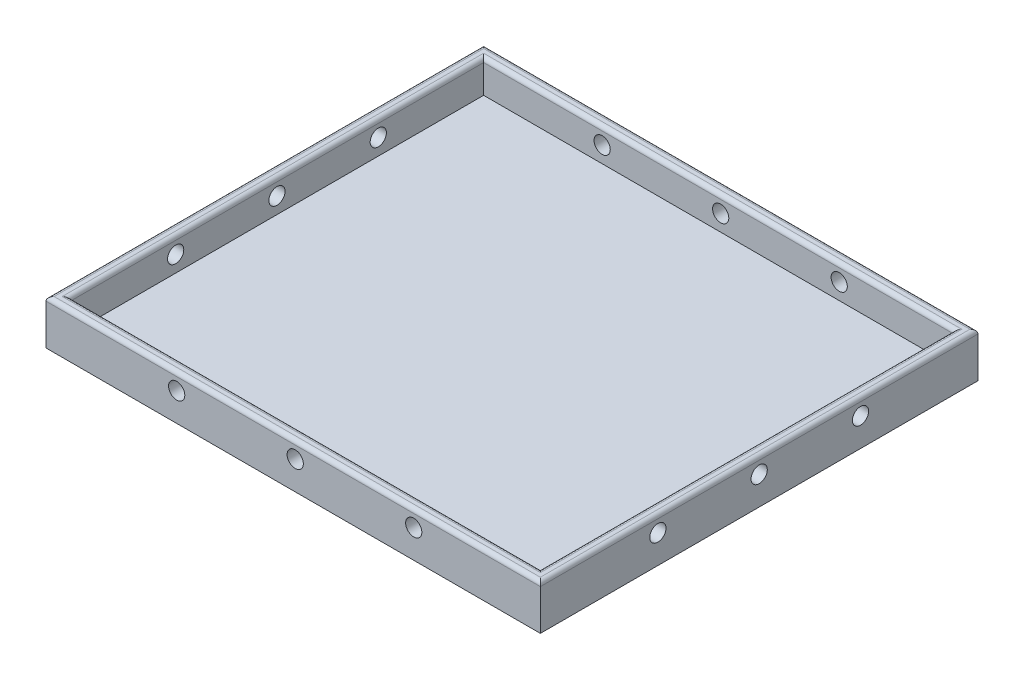
ISO-10303-21;
HEADER;
FILE_DESCRIPTION(('STEP AP214'),'2;1');
FILE_NAME('part.step','',(''),(''),'','','');
FILE_SCHEMA(('AUTOMOTIVE_DESIGN { 1 0 10303 214 1 1 1 1 }'));
ENDSEC;
DATA;
#1=APPLICATION_CONTEXT('core data for automotive mechanical design processes');
#2=APPLICATION_PROTOCOL_DEFINITION('international standard','automotive_design',2000,#1);
#3=PRODUCT_CONTEXT('',#1,'mechanical');
#4=PRODUCT('Part','Part','',(#3));
#5=PRODUCT_RELATED_PRODUCT_CATEGORY('part','',(#4));
#6=PRODUCT_DEFINITION_FORMATION('','',#4);
#7=PRODUCT_DEFINITION_CONTEXT('part definition',#1,'design');
#8=PRODUCT_DEFINITION('design','',#6,#7);
#9=PRODUCT_DEFINITION_SHAPE('','',#8);
#10=(LENGTH_UNIT() NAMED_UNIT(*) SI_UNIT(.MILLI.,.METRE.));
#11=(NAMED_UNIT(*) PLANE_ANGLE_UNIT() SI_UNIT($,.RADIAN.));
#12=(NAMED_UNIT(*) SI_UNIT($,.STERADIAN.) SOLID_ANGLE_UNIT());
#13=UNCERTAINTY_MEASURE_WITH_UNIT(LENGTH_MEASURE(1.E-05),#10,'distance_accuracy_value','');
#14=(GEOMETRIC_REPRESENTATION_CONTEXT(3) GLOBAL_UNCERTAINTY_ASSIGNED_CONTEXT((#13)) GLOBAL_UNIT_ASSIGNED_CONTEXT((#10,
#11,#12)) REPRESENTATION_CONTEXT('',''));
#15=CARTESIAN_POINT('',(0.,0.,0.));
#16=DIRECTION('',(0.,0.,1.));
#17=DIRECTION('',(1.,0.,0.));
#18=AXIS2_PLACEMENT_3D('',#15,#16,#17);
#19=CARTESIAN_POINT('',(-201.609907120743,11.,-77.8947368421052));
#20=DIRECTION('',(1.,0.,0.));
#21=DIRECTION('',(0.,0.,-1.));
#22=AXIS2_PLACEMENT_3D('',#19,#20,#21);
#23=PLANE('',#22);
#24=CARTESIAN_POINT('',(-201.609907120743,6.99999997663109,1.10526315789476));
#25=DIRECTION('',(1.,0.,0.));
#26=DIRECTION('',(0.,0.,-1.));
#27=AXIS2_PLACEMENT_3D('',#24,#25,#26);
#28=CIRCLE('',#27,1.99999999316759);
#29=CARTESIAN_POINT('',(-201.609907120743,6.99999997663109,-0.894736835272832));
#30=VERTEX_POINT('',#29);
#31=EDGE_CURVE('E190',#30,#30,#28,.T.);
#32=ORIENTED_EDGE('',*,*,#31,.T.);
#33=EDGE_LOOP('',(#32));
#34=FACE_BOUND('',#33,.T.);
#35=CARTESIAN_POINT('',(-201.609907120743,6.99999998831555,-23.8947368421052));
#36=DIRECTION('',(1.,0.,0.));
#37=DIRECTION('',(0.,0.,-1.));
#38=AXIS2_PLACEMENT_3D('',#35,#36,#37);
#39=CIRCLE('',#38,1.9999999931676);
#40=CARTESIAN_POINT('',(-201.609907120743,6.99999998831555,-25.8947368352728));
#41=VERTEX_POINT('',#40);
#42=EDGE_CURVE('E593',#41,#41,#39,.T.);
#43=ORIENTED_EDGE('',*,*,#42,.T.);
#44=EDGE_LOOP('',(#43));
#45=FACE_BOUND('',#44,.T.);
#46=CARTESIAN_POINT('',(-201.609907120743,7.,-48.8947368421052));
#47=DIRECTION('',(1.,0.,0.));
#48=DIRECTION('',(0.,0.,-1.));
#49=AXIS2_PLACEMENT_3D('',#46,#47,#48);
#50=CIRCLE('',#49,2.);
#51=CARTESIAN_POINT('',(-201.609907120743,7.,-50.8947368421052));
#52=VERTEX_POINT('',#51);
#53=EDGE_CURVE('E586',#52,#52,#50,.T.);
#54=ORIENTED_EDGE('',*,*,#53,.T.);
#55=EDGE_LOOP('',(#54));
#56=FACE_BOUND('',#55,.T.);
#57=DIRECTION('',(0.,-1.,0.));
#58=VECTOR('',#57,1.);
#59=CARTESIAN_POINT('',(-201.609907120743,11.,30.1052631578948));
#60=LINE('',#59,#58);
#61=CARTESIAN_POINT('',(-201.609907120743,10.,30.1052631578948));
#62=VERTEX_POINT('',#61);
#63=CARTESIAN_POINT('',(-201.609907120743,0.,30.1052631578948));
#64=VERTEX_POINT('',#63);
#65=EDGE_CURVE('E183',#62,#64,#60,.T.);
#66=ORIENTED_EDGE('',*,*,#65,.F.);
#67=DIRECTION('',(0.,0.,1.));
#68=VECTOR('',#67,1.);
#69=CARTESIAN_POINT('',(-201.609907120743,10.,-77.8947368421052));
#70=LINE('',#69,#68);
#71=CARTESIAN_POINT('',(-201.609907120743,10.,-77.8947368421052));
#72=VERTEX_POINT('',#71);
#73=EDGE_CURVE('E44',#62,#72,#70,.F.);
#74=ORIENTED_EDGE('',*,*,#73,.T.);
#75=DIRECTION('',(0.,-1.,0.));
#76=VECTOR('',#75,1.);
#77=CARTESIAN_POINT('',(-201.609907120743,11.,-77.8947368421052));
#78=LINE('',#77,#76);
#79=CARTESIAN_POINT('',(-201.609907120743,0.,-77.8947368421052));
#80=VERTEX_POINT('',#79);
#81=EDGE_CURVE('E177',#72,#80,#78,.T.);
#82=ORIENTED_EDGE('',*,*,#81,.T.);
#83=DIRECTION('',(0.,0.,1.));
#84=VECTOR('',#83,1.);
#85=CARTESIAN_POINT('',(-201.609907120743,0.,-77.8947368421052));
#86=LINE('',#85,#84);
#87=EDGE_CURVE('E162',#80,#64,#86,.T.);
#88=ORIENTED_EDGE('',*,*,#87,.T.);
#89=EDGE_LOOP('',(#66,#74,#82,#88));
#90=FACE_BOUND('',#89,.T.);
#91=ADVANCED_FACE('F35',(#34,#45,#56,#90),#23,.F.);
#92=CARTESIAN_POINT('',(-201.609907120743,11.,30.1052631578948));
#93=DIRECTION('',(0.,0.,-1.));
#94=DIRECTION('',(-1.,0.,0.));
#95=AXIS2_PLACEMENT_3D('',#92,#93,#94);
#96=PLANE('',#95);
#97=CARTESIAN_POINT('',(-169.359907120743,7.,30.1052631578948));
#98=DIRECTION('',(0.,0.,1.));
#99=DIRECTION('',(1.,0.,0.));
#100=AXIS2_PLACEMENT_3D('',#97,#98,#99);
#101=CIRCLE('',#100,2.);
#102=CARTESIAN_POINT('',(-167.359907120743,7.,30.1052631578948));
#103=VERTEX_POINT('',#102);
#104=EDGE_CURVE('E621',#103,#103,#101,.T.);
#105=ORIENTED_EDGE('',*,*,#104,.F.);
#106=EDGE_LOOP('',(#105));
#107=FACE_BOUND('',#106,.T.);
#108=CARTESIAN_POINT('',(-140.109907120743,7.,30.1052631578948));
#109=DIRECTION('',(0.,0.,1.));
#110=DIRECTION('',(1.,0.,0.));
#111=AXIS2_PLACEMENT_3D('',#108,#109,#110);
#112=CIRCLE('',#111,2.);
#113=CARTESIAN_POINT('',(-138.109907120743,7.,30.1052631578948));
#114=VERTEX_POINT('',#113);
#115=EDGE_CURVE('E615',#114,#114,#112,.T.);
#116=ORIENTED_EDGE('',*,*,#115,.F.);
#117=EDGE_LOOP('',(#116));
#118=FACE_BOUND('',#117,.T.);
#119=CARTESIAN_POINT('',(-110.859907120743,7.,30.1052631578948));
#120=DIRECTION('',(0.,0.,1.));
#121=DIRECTION('',(1.,0.,0.));
#122=AXIS2_PLACEMENT_3D('',#119,#120,#121);
#123=CIRCLE('',#122,2.);
#124=CARTESIAN_POINT('',(-108.859907120743,7.,30.1052631578948));
#125=VERTEX_POINT('',#124);
#126=EDGE_CURVE('E249',#125,#125,#123,.T.);
#127=ORIENTED_EDGE('',*,*,#126,.F.);
#128=EDGE_LOOP('',(#127));
#129=FACE_BOUND('',#128,.T.);
#130=DIRECTION('',(0.,-1.,0.));
#131=VECTOR('',#130,1.);
#132=CARTESIAN_POINT('',(-79.6099071207431,11.,30.1052631578948));
#133=LINE('',#132,#131);
#134=CARTESIAN_POINT('',(-79.6099071207431,10.,30.1052631578948));
#135=VERTEX_POINT('',#134);
#136=CARTESIAN_POINT('',(-79.6099071207431,0.,30.1052631578948));
#137=VERTEX_POINT('',#136);
#138=EDGE_CURVE('E181',#135,#137,#133,.T.);
#139=ORIENTED_EDGE('',*,*,#138,.F.);
#140=DIRECTION('',(1.,0.,0.));
#141=VECTOR('',#140,1.);
#142=CARTESIAN_POINT('',(-201.609907120743,10.,30.1052631578948));
#143=LINE('',#142,#141);
#144=EDGE_CURVE('E229',#135,#62,#143,.F.);
#145=ORIENTED_EDGE('',*,*,#144,.T.);
#146=ORIENTED_EDGE('',*,*,#65,.T.);
#147=DIRECTION('',(1.,0.,0.));
#148=VECTOR('',#147,1.);
#149=CARTESIAN_POINT('',(-201.609907120743,0.,30.1052631578948));
#150=LINE('',#149,#148);
#151=EDGE_CURVE('E168',#64,#137,#150,.T.);
#152=ORIENTED_EDGE('',*,*,#151,.T.);
#153=EDGE_LOOP('',(#139,#145,#146,#152));
#154=FACE_BOUND('',#153,.T.);
#155=ADVANCED_FACE('F281',(#107,#118,#129,#154),#96,.F.);
#156=CARTESIAN_POINT('',(-79.6099071207431,11.,-77.8947368421052));
#157=DIRECTION('',(-1.,0.,0.));
#158=DIRECTION('',(0.,0.,1.));
#159=AXIS2_PLACEMENT_3D('',#156,#157,#158);
#160=PLANE('',#159);
#161=CARTESIAN_POINT('',(-79.6099071207431,6.99999997663109,1.10526315789476));
#162=DIRECTION('',(1.,0.,0.));
#163=DIRECTION('',(0.,0.,-1.));
#164=AXIS2_PLACEMENT_3D('',#161,#162,#163);
#165=CIRCLE('',#164,1.99999999316759);
#166=CARTESIAN_POINT('',(-79.6099071207431,6.99999997663109,-0.894736835272832));
#167=VERTEX_POINT('',#166);
#168=EDGE_CURVE('E578',#167,#167,#165,.T.);
#169=ORIENTED_EDGE('',*,*,#168,.F.);
#170=EDGE_LOOP('',(#169));
#171=FACE_BOUND('',#170,.T.);
#172=CARTESIAN_POINT('',(-79.6099071207431,6.99999998831555,-23.8947368421052));
#173=DIRECTION('',(1.,0.,0.));
#174=DIRECTION('',(0.,0.,-1.));
#175=AXIS2_PLACEMENT_3D('',#172,#173,#174);
#176=CIRCLE('',#175,1.9999999931676);
#177=CARTESIAN_POINT('',(-79.6099071207431,6.99999998831555,-25.8947368352728));
#178=VERTEX_POINT('',#177);
#179=EDGE_CURVE('E582',#178,#178,#176,.T.);
#180=ORIENTED_EDGE('',*,*,#179,.F.);
#181=EDGE_LOOP('',(#180));
#182=FACE_BOUND('',#181,.T.);
#183=CARTESIAN_POINT('',(-79.6099071207431,7.,-48.8947368421052));
#184=DIRECTION('',(1.,0.,0.));
#185=DIRECTION('',(0.,0.,-1.));
#186=AXIS2_PLACEMENT_3D('',#183,#184,#185);
#187=CIRCLE('',#186,2.);
#188=CARTESIAN_POINT('',(-79.6099071207431,7.,-50.8947368421052));
#189=VERTEX_POINT('',#188);
#190=EDGE_CURVE('E585',#189,#189,#187,.T.);
#191=ORIENTED_EDGE('',*,*,#190,.F.);
#192=EDGE_LOOP('',(#191));
#193=FACE_BOUND('',#192,.T.);
#194=DIRECTION('',(0.,-1.,0.));
#195=VECTOR('',#194,1.);
#196=CARTESIAN_POINT('',(-79.6099071207431,11.,-77.8947368421052));
#197=LINE('',#196,#195);
#198=CARTESIAN_POINT('',(-79.6099071207431,10.,-77.8947368421052));
#199=VERTEX_POINT('',#198);
#200=CARTESIAN_POINT('',(-79.6099071207431,0.,-77.8947368421052));
#201=VERTEX_POINT('',#200);
#202=EDGE_CURVE('E179',#199,#201,#197,.T.);
#203=ORIENTED_EDGE('',*,*,#202,.F.);
#204=DIRECTION('',(0.,0.,-1.));
#205=VECTOR('',#204,1.);
#206=CARTESIAN_POINT('',(-79.6099071207431,10.,30.1052631578948));
#207=LINE('',#206,#205);
#208=EDGE_CURVE('E232',#199,#135,#207,.F.);
#209=ORIENTED_EDGE('',*,*,#208,.T.);
#210=ORIENTED_EDGE('',*,*,#138,.T.);
#211=DIRECTION('',(0.,0.,-1.));
#212=VECTOR('',#211,1.);
#213=CARTESIAN_POINT('',(-79.6099071207431,0.,-77.8947368421052));
#214=LINE('',#213,#212);
#215=EDGE_CURVE('E171',#137,#201,#214,.T.);
#216=ORIENTED_EDGE('',*,*,#215,.T.);
#217=EDGE_LOOP('',(#203,#209,#210,#216));
#218=FACE_BOUND('',#217,.T.);
#219=ADVANCED_FACE('F272',(#171,#182,#193,#218),#160,.F.);
#220=CARTESIAN_POINT('',(-201.609907120743,11.,-77.8947368421052));
#221=DIRECTION('',(0.,0.,1.));
#222=DIRECTION('',(1.,0.,0.));
#223=AXIS2_PLACEMENT_3D('',#220,#221,#222);
#224=PLANE('',#223);
#225=CARTESIAN_POINT('',(-169.359907120743,7.,-77.8947368421052));
#226=DIRECTION('',(0.,0.,1.));
#227=DIRECTION('',(1.,0.,0.));
#228=AXIS2_PLACEMENT_3D('',#225,#226,#227);
#229=CIRCLE('',#228,2.);
#230=CARTESIAN_POINT('',(-167.359907120743,7.,-77.8947368421052));
#231=VERTEX_POINT('',#230);
#232=EDGE_CURVE('E201',#231,#231,#229,.T.);
#233=ORIENTED_EDGE('',*,*,#232,.T.);
#234=EDGE_LOOP('',(#233));
#235=FACE_BOUND('',#234,.T.);
#236=CARTESIAN_POINT('',(-140.109907120743,7.,-77.8947368421052));
#237=DIRECTION('',(0.,0.,1.));
#238=DIRECTION('',(1.,0.,0.));
#239=AXIS2_PLACEMENT_3D('',#236,#237,#238);
#240=CIRCLE('',#239,2.);
#241=CARTESIAN_POINT('',(-138.109907120743,7.,-77.8947368421052));
#242=VERTEX_POINT('',#241);
#243=EDGE_CURVE('E618',#242,#242,#240,.T.);
#244=ORIENTED_EDGE('',*,*,#243,.T.);
#245=EDGE_LOOP('',(#244));
#246=FACE_BOUND('',#245,.T.);
#247=CARTESIAN_POINT('',(-110.859907120743,7.,-77.8947368421052));
#248=DIRECTION('',(0.,0.,1.));
#249=DIRECTION('',(1.,0.,0.));
#250=AXIS2_PLACEMENT_3D('',#247,#248,#249);
#251=CIRCLE('',#250,2.);
#252=CARTESIAN_POINT('',(-108.859907120743,7.,-77.8947368421052));
#253=VERTEX_POINT('',#252);
#254=EDGE_CURVE('E612',#253,#253,#251,.T.);
#255=ORIENTED_EDGE('',*,*,#254,.T.);
#256=EDGE_LOOP('',(#255));
#257=FACE_BOUND('',#256,.T.);
#258=ORIENTED_EDGE('',*,*,#81,.F.);
#259=DIRECTION('',(-1.,0.,0.));
#260=VECTOR('',#259,1.);
#261=CARTESIAN_POINT('',(-79.6099071207431,10.,-77.8947368421052));
#262=LINE('',#261,#260);
#263=EDGE_CURVE('E11',#72,#199,#262,.F.);
#264=ORIENTED_EDGE('',*,*,#263,.T.);
#265=ORIENTED_EDGE('',*,*,#202,.T.);
#266=DIRECTION('',(-1.,0.,0.));
#267=VECTOR('',#266,1.);
#268=CARTESIAN_POINT('',(-201.609907120743,0.,-77.8947368421052));
#269=LINE('',#268,#267);
#270=EDGE_CURVE('E174',#201,#80,#269,.T.);
#271=ORIENTED_EDGE('',*,*,#270,.T.);
#272=EDGE_LOOP('',(#258,#264,#265,#271));
#273=FACE_BOUND('',#272,.T.);
#274=ADVANCED_FACE('F270',(#235,#246,#257,#273),#224,.F.);
#275=CARTESIAN_POINT('',(0.,11.,0.));
#276=DIRECTION('',(0.,1.,0.));
#277=DIRECTION('',(0.,0.,1.));
#278=AXIS2_PLACEMENT_3D('',#275,#276,#277);
#279=PLANE('',#278);
#280=DIRECTION('',(0.,0.,-1.));
#281=VECTOR('',#280,1.);
#282=CARTESIAN_POINT('',(-81.6099071207431,11.,27.1052631578948));
#283=LINE('',#282,#281);
#284=CARTESIAN_POINT('',(-81.6099071207431,11.,-75.8947368421052));
#285=VERTEX_POINT('',#284);
#286=CARTESIAN_POINT('',(-81.6099071207431,11.,28.1052631578948));
#287=VERTEX_POINT('',#286);
#288=EDGE_CURVE('E224',#285,#287,#283,.F.);
#289=ORIENTED_EDGE('',*,*,#288,.T.);
#290=DIRECTION('',(1.,0.,0.));
#291=VECTOR('',#290,1.);
#292=CARTESIAN_POINT('',(-198.609907120743,11.,28.1052631578948));
#293=LINE('',#292,#291);
#294=CARTESIAN_POINT('',(-199.609907120743,11.,28.1052631578948));
#295=VERTEX_POINT('',#294);
#296=EDGE_CURVE('E226',#287,#295,#293,.F.);
#297=ORIENTED_EDGE('',*,*,#296,.T.);
#298=DIRECTION('',(0.,0.,1.));
#299=VECTOR('',#298,1.);
#300=CARTESIAN_POINT('',(-199.609907120743,11.,-74.8947368421052));
#301=LINE('',#300,#299);
#302=CARTESIAN_POINT('',(-199.609907120743,11.,-75.8947368421052));
#303=VERTEX_POINT('',#302);
#304=EDGE_CURVE('E222',#295,#303,#301,.F.);
#305=ORIENTED_EDGE('',*,*,#304,.T.);
#306=DIRECTION('',(-1.,0.,0.));
#307=VECTOR('',#306,1.);
#308=CARTESIAN_POINT('',(-82.6099071207431,11.,-75.8947368421052));
#309=LINE('',#308,#307);
#310=EDGE_CURVE('E220',#303,#285,#309,.F.);
#311=ORIENTED_EDGE('',*,*,#310,.T.);
#312=EDGE_LOOP('',(#289,#297,#305,#311));
#313=FACE_BOUND('',#312,.T.);
#314=DIRECTION('',(0.,0.,1.));
#315=VECTOR('',#314,1.);
#316=CARTESIAN_POINT('',(-200.609907120743,11.,30.1052631578948));
#317=LINE('',#316,#315);
#318=CARTESIAN_POINT('',(-200.609907120743,11.,-76.8947368421052));
#319=VERTEX_POINT('',#318);
#320=CARTESIAN_POINT('',(-200.609907120743,11.,29.1052631578948));
#321=VERTEX_POINT('',#320);
#322=EDGE_CURVE('E213',#319,#321,#317,.T.);
#323=ORIENTED_EDGE('',*,*,#322,.T.);
#324=DIRECTION('',(1.,0.,0.));
#325=VECTOR('',#324,1.);
#326=CARTESIAN_POINT('',(-79.6099071207431,11.,29.1052631578948));
#327=LINE('',#326,#325);
#328=CARTESIAN_POINT('',(-80.6099071207431,11.,29.1052631578948));
#329=VERTEX_POINT('',#328);
#330=EDGE_CURVE('E217',#321,#329,#327,.T.);
#331=ORIENTED_EDGE('',*,*,#330,.T.);
#332=DIRECTION('',(0.,0.,-1.));
#333=VECTOR('',#332,1.);
#334=CARTESIAN_POINT('',(-80.6099071207431,11.,-77.8947368421052));
#335=LINE('',#334,#333);
#336=CARTESIAN_POINT('',(-80.6099071207431,11.,-76.8947368421052));
#337=VERTEX_POINT('',#336);
#338=EDGE_CURVE('E215',#329,#337,#335,.T.);
#339=ORIENTED_EDGE('',*,*,#338,.T.);
#340=DIRECTION('',(-1.,0.,0.));
#341=VECTOR('',#340,1.);
#342=CARTESIAN_POINT('',(-201.609907120743,11.,-76.8947368421052));
#343=LINE('',#342,#341);
#344=EDGE_CURVE('E211',#337,#319,#343,.T.);
#345=ORIENTED_EDGE('',*,*,#344,.T.);
#346=EDGE_LOOP('',(#323,#331,#339,#345));
#347=FACE_BOUND('',#346,.T.);
#348=ADVANCED_FACE('F289',(#313,#347),#279,.T.);
#349=CARTESIAN_POINT('',(0.,0.,0.));
#350=DIRECTION('',(0.,1.,0.));
#351=DIRECTION('',(0.,0.,1.));
#352=AXIS2_PLACEMENT_3D('',#349,#350,#351);
#353=PLANE('',#352);
#354=ORIENTED_EDGE('',*,*,#87,.F.);
#355=ORIENTED_EDGE('',*,*,#270,.F.);
#356=ORIENTED_EDGE('',*,*,#215,.F.);
#357=ORIENTED_EDGE('',*,*,#151,.F.);
#358=EDGE_LOOP('',(#354,#355,#356,#357));
#359=FACE_BOUND('',#358,.T.);
#360=ADVANCED_FACE('F279',(#359),#353,.F.);
#361=CARTESIAN_POINT('',(-198.609907120743,3.,-74.8947368421052));
#362=DIRECTION('',(-1.,0.,0.));
#363=DIRECTION('',(0.,0.,1.));
#364=AXIS2_PLACEMENT_3D('',#361,#362,#363);
#365=PLANE('',#364);
#366=CARTESIAN_POINT('',(-198.609907120743,6.99999997663109,1.10526315789476));
#367=DIRECTION('',(-1.,0.,0.));
#368=DIRECTION('',(0.,0.,1.));
#369=AXIS2_PLACEMENT_3D('',#366,#367,#368);
#370=CIRCLE('',#369,1.99999999316759);
#371=CARTESIAN_POINT('',(-198.609907120743,6.99999997663109,3.10526315106236));
#372=VERTEX_POINT('',#371);
#373=EDGE_CURVE('E151',#372,#372,#370,.T.);
#374=ORIENTED_EDGE('',*,*,#373,.T.);
#375=EDGE_LOOP('',(#374));
#376=FACE_BOUND('',#375,.T.);
#377=CARTESIAN_POINT('',(-198.609907120743,6.99999998831555,-23.8947368421052));
#378=DIRECTION('',(-1.,0.,0.));
#379=DIRECTION('',(0.,0.,1.));
#380=AXIS2_PLACEMENT_3D('',#377,#378,#379);
#381=CIRCLE('',#380,1.9999999931676);
#382=CARTESIAN_POINT('',(-198.609907120743,6.99999998831555,-21.8947368489376));
#383=VERTEX_POINT('',#382);
#384=EDGE_CURVE('E194',#383,#383,#381,.T.);
#385=ORIENTED_EDGE('',*,*,#384,.T.);
#386=EDGE_LOOP('',(#385));
#387=FACE_BOUND('',#386,.T.);
#388=CARTESIAN_POINT('',(-198.609907120743,7.,-48.8947368421052));
#389=DIRECTION('',(-1.,0.,0.));
#390=DIRECTION('',(0.,0.,1.));
#391=AXIS2_PLACEMENT_3D('',#388,#389,#390);
#392=CIRCLE('',#391,2.);
#393=CARTESIAN_POINT('',(-198.609907120743,7.,-46.8947368421052));
#394=VERTEX_POINT('',#393);
#395=EDGE_CURVE('E189',#394,#394,#392,.T.);
#396=ORIENTED_EDGE('',*,*,#395,.T.);
#397=EDGE_LOOP('',(#396));
#398=FACE_BOUND('',#397,.T.);
#399=DIRECTION('',(0.,1.,0.));
#400=VECTOR('',#399,1.);
#401=CARTESIAN_POINT('',(-198.609907120743,3.,-74.8947368421052));
#402=LINE('',#401,#400);
#403=CARTESIAN_POINT('',(-198.609907120743,3.,-74.8947368421052));
#404=VERTEX_POINT('',#403);
#405=CARTESIAN_POINT('',(-198.609907120743,10.,-74.8947368421052));
#406=VERTEX_POINT('',#405);
#407=EDGE_CURVE('E160',#404,#406,#402,.T.);
#408=ORIENTED_EDGE('',*,*,#407,.T.);
#409=DIRECTION('',(0.,0.,1.));
#410=VECTOR('',#409,1.);
#411=CARTESIAN_POINT('',(-198.609907120743,10.,27.1052631578948));
#412=LINE('',#411,#410);
#413=CARTESIAN_POINT('',(-198.609907120743,10.,27.1052631578948));
#414=VERTEX_POINT('',#413);
#415=EDGE_CURVE('E133',#406,#414,#412,.T.);
#416=ORIENTED_EDGE('',*,*,#415,.T.);
#417=DIRECTION('',(0.,1.,0.));
#418=VECTOR('',#417,1.);
#419=CARTESIAN_POINT('',(-198.609907120743,3.,27.1052631578948));
#420=LINE('',#419,#418);
#421=CARTESIAN_POINT('',(-198.609907120743,3.,27.1052631578948));
#422=VERTEX_POINT('',#421);
#423=EDGE_CURVE('E126',#422,#414,#420,.T.);
#424=ORIENTED_EDGE('',*,*,#423,.F.);
#425=DIRECTION('',(0.,0.,1.));
#426=VECTOR('',#425,1.);
#427=CARTESIAN_POINT('',(-198.609907120743,3.,-74.8947368421052));
#428=LINE('',#427,#426);
#429=EDGE_CURVE('E130',#404,#422,#428,.T.);
#430=ORIENTED_EDGE('',*,*,#429,.F.);
#431=EDGE_LOOP('',(#408,#416,#424,#430));
#432=FACE_BOUND('',#431,.T.);
#433=ADVANCED_FACE('F128',(#376,#387,#398,#432),#365,.F.);
#434=CARTESIAN_POINT('',(-198.609907120743,3.,-74.8947368421052));
#435=DIRECTION('',(0.,0.,-1.));
#436=DIRECTION('',(-1.,0.,0.));
#437=AXIS2_PLACEMENT_3D('',#434,#435,#436);
#438=PLANE('',#437);
#439=CARTESIAN_POINT('',(-169.359907120743,7.,-74.8947368421052));
#440=DIRECTION('',(0.,0.,-1.));
#441=DIRECTION('',(-1.,0.,0.));
#442=AXIS2_PLACEMENT_3D('',#439,#440,#441);
#443=CIRCLE('',#442,2.);
#444=CARTESIAN_POINT('',(-171.359907120743,7.,-74.8947368421052));
#445=VERTEX_POINT('',#444);
#446=EDGE_CURVE('E209',#445,#445,#443,.T.);
#447=ORIENTED_EDGE('',*,*,#446,.T.);
#448=EDGE_LOOP('',(#447));
#449=FACE_BOUND('',#448,.T.);
#450=CARTESIAN_POINT('',(-140.109907120743,7.,-74.8947368421052));
#451=DIRECTION('',(0.,0.,-1.));
#452=DIRECTION('',(-1.,0.,0.));
#453=AXIS2_PLACEMENT_3D('',#450,#451,#452);
#454=CIRCLE('',#453,2.);
#455=CARTESIAN_POINT('',(-142.109907120743,7.,-74.8947368421052));
#456=VERTEX_POINT('',#455);
#457=EDGE_CURVE('E205',#456,#456,#454,.T.);
#458=ORIENTED_EDGE('',*,*,#457,.T.);
#459=EDGE_LOOP('',(#458));
#460=FACE_BOUND('',#459,.T.);
#461=CARTESIAN_POINT('',(-110.859907120743,7.,-74.8947368421052));
#462=DIRECTION('',(0.,0.,-1.));
#463=DIRECTION('',(-1.,0.,0.));
#464=AXIS2_PLACEMENT_3D('',#461,#462,#463);
#465=CIRCLE('',#464,2.);
#466=CARTESIAN_POINT('',(-112.859907120743,7.,-74.8947368421052));
#467=VERTEX_POINT('',#466);
#468=EDGE_CURVE('E200',#467,#467,#465,.T.);
#469=ORIENTED_EDGE('',*,*,#468,.T.);
#470=EDGE_LOOP('',(#469));
#471=FACE_BOUND('',#470,.T.);
#472=DIRECTION('',(0.,1.,0.));
#473=VECTOR('',#472,1.);
#474=CARTESIAN_POINT('',(-82.6099071207431,3.,-74.8947368421052));
#475=LINE('',#474,#473);
#476=CARTESIAN_POINT('',(-82.6099071207431,3.,-74.8947368421052));
#477=VERTEX_POINT('',#476);
#478=CARTESIAN_POINT('',(-82.6099071207431,10.,-74.8947368421052));
#479=VERTEX_POINT('',#478);
#480=EDGE_CURVE('E163',#477,#479,#475,.T.);
#481=ORIENTED_EDGE('',*,*,#480,.T.);
#482=DIRECTION('',(-1.,0.,0.));
#483=VECTOR('',#482,1.);
#484=CARTESIAN_POINT('',(-198.609907120743,10.,-74.8947368421052));
#485=LINE('',#484,#483);
#486=EDGE_CURVE('E59',#479,#406,#485,.T.);
#487=ORIENTED_EDGE('',*,*,#486,.T.);
#488=ORIENTED_EDGE('',*,*,#407,.F.);
#489=DIRECTION('',(-1.,0.,0.));
#490=VECTOR('',#489,1.);
#491=CARTESIAN_POINT('',(-198.609907120743,3.,-74.8947368421052));
#492=LINE('',#491,#490);
#493=EDGE_CURVE('E138',#477,#404,#492,.T.);
#494=ORIENTED_EDGE('',*,*,#493,.F.);
#495=EDGE_LOOP('',(#481,#487,#488,#494));
#496=FACE_BOUND('',#495,.T.);
#497=ADVANCED_FACE('F465',(#449,#460,#471,#496),#438,.F.);
#498=CARTESIAN_POINT('',(-82.6099071207431,3.,-74.8947368421052));
#499=DIRECTION('',(1.,0.,0.));
#500=DIRECTION('',(0.,0.,-1.));
#501=AXIS2_PLACEMENT_3D('',#498,#499,#500);
#502=PLANE('',#501);
#503=CARTESIAN_POINT('',(-82.6099071207431,6.99999997663109,1.10526315789476));
#504=DIRECTION('',(1.,0.,0.));
#505=DIRECTION('',(0.,0.,-1.));
#506=AXIS2_PLACEMENT_3D('',#503,#504,#505);
#507=CIRCLE('',#506,1.99999999316759);
#508=CARTESIAN_POINT('',(-82.6099071207431,6.99999997663109,-0.894736835272832));
#509=VERTEX_POINT('',#508);
#510=EDGE_CURVE('E154',#509,#509,#507,.T.);
#511=ORIENTED_EDGE('',*,*,#510,.T.);
#512=EDGE_LOOP('',(#511));
#513=FACE_BOUND('',#512,.T.);
#514=CARTESIAN_POINT('',(-82.6099071207431,6.99999998831555,-23.8947368421052));
#515=DIRECTION('',(1.,0.,0.));
#516=DIRECTION('',(0.,0.,-1.));
#517=AXIS2_PLACEMENT_3D('',#514,#515,#516);
#518=CIRCLE('',#517,1.9999999931676);
#519=CARTESIAN_POINT('',(-82.6099071207431,6.99999998831555,-25.8947368352728));
#520=VERTEX_POINT('',#519);
#521=EDGE_CURVE('E191',#520,#520,#518,.T.);
#522=ORIENTED_EDGE('',*,*,#521,.T.);
#523=EDGE_LOOP('',(#522));
#524=FACE_BOUND('',#523,.T.);
#525=CARTESIAN_POINT('',(-82.6099071207431,7.,-48.8947368421052));
#526=DIRECTION('',(1.,0.,0.));
#527=DIRECTION('',(0.,0.,-1.));
#528=AXIS2_PLACEMENT_3D('',#525,#526,#527);
#529=CIRCLE('',#528,2.);
#530=CARTESIAN_POINT('',(-82.6099071207431,7.,-50.8947368421052));
#531=VERTEX_POINT('',#530);
#532=EDGE_CURVE('E186',#531,#531,#529,.T.);
#533=ORIENTED_EDGE('',*,*,#532,.T.);
#534=EDGE_LOOP('',(#533));
#535=FACE_BOUND('',#534,.T.);
#536=DIRECTION('',(0.,1.,0.));
#537=VECTOR('',#536,1.);
#538=CARTESIAN_POINT('',(-82.6099071207431,3.,27.1052631578948));
#539=LINE('',#538,#537);
#540=CARTESIAN_POINT('',(-82.6099071207431,3.,27.1052631578948));
#541=VERTEX_POINT('',#540);
#542=CARTESIAN_POINT('',(-82.6099071207431,10.,27.1052631578948));
#543=VERTEX_POINT('',#542);
#544=EDGE_CURVE('E137',#541,#543,#539,.T.);
#545=ORIENTED_EDGE('',*,*,#544,.T.);
#546=DIRECTION('',(0.,0.,-1.));
#547=VECTOR('',#546,1.);
#548=CARTESIAN_POINT('',(-82.6099071207431,10.,-74.8947368421052));
#549=LINE('',#548,#547);
#550=EDGE_CURVE('E234',#543,#479,#549,.T.);
#551=ORIENTED_EDGE('',*,*,#550,.T.);
#552=ORIENTED_EDGE('',*,*,#480,.F.);
#553=DIRECTION('',(0.,0.,-1.));
#554=VECTOR('',#553,1.);
#555=CARTESIAN_POINT('',(-82.6099071207431,3.,-74.8947368421052));
#556=LINE('',#555,#554);
#557=EDGE_CURVE('E147',#541,#477,#556,.T.);
#558=ORIENTED_EDGE('',*,*,#557,.F.);
#559=EDGE_LOOP('',(#545,#551,#552,#558));
#560=FACE_BOUND('',#559,.T.);
#561=ADVANCED_FACE('F457',(#513,#524,#535,#560),#502,.F.);
#562=CARTESIAN_POINT('',(-198.609907120743,3.,27.1052631578948));
#563=DIRECTION('',(0.,0.,1.));
#564=DIRECTION('',(1.,0.,0.));
#565=AXIS2_PLACEMENT_3D('',#562,#563,#564);
#566=PLANE('',#565);
#567=CARTESIAN_POINT('',(-169.359907120743,7.,27.1052631578948));
#568=DIRECTION('',(0.,0.,1.));
#569=DIRECTION('',(1.,0.,0.));
#570=AXIS2_PLACEMENT_3D('',#567,#568,#569);
#571=CIRCLE('',#570,2.);
#572=CARTESIAN_POINT('',(-167.359907120743,7.,27.1052631578948));
#573=VERTEX_POINT('',#572);
#574=EDGE_CURVE('E206',#573,#573,#571,.T.);
#575=ORIENTED_EDGE('',*,*,#574,.T.);
#576=EDGE_LOOP('',(#575));
#577=FACE_BOUND('',#576,.T.);
#578=CARTESIAN_POINT('',(-140.109907120743,7.,27.1052631578948));
#579=DIRECTION('',(0.,0.,1.));
#580=DIRECTION('',(1.,0.,0.));
#581=AXIS2_PLACEMENT_3D('',#578,#579,#580);
#582=CIRCLE('',#581,2.);
#583=CARTESIAN_POINT('',(-138.109907120743,7.,27.1052631578948));
#584=VERTEX_POINT('',#583);
#585=EDGE_CURVE('E202',#584,#584,#582,.T.);
#586=ORIENTED_EDGE('',*,*,#585,.T.);
#587=EDGE_LOOP('',(#586));
#588=FACE_BOUND('',#587,.T.);
#589=CARTESIAN_POINT('',(-110.859907120743,7.,27.1052631578948));
#590=DIRECTION('',(0.,0.,1.));
#591=DIRECTION('',(1.,0.,0.));
#592=AXIS2_PLACEMENT_3D('',#589,#590,#591);
#593=CIRCLE('',#592,2.);
#594=CARTESIAN_POINT('',(-108.859907120743,7.,27.1052631578948));
#595=VERTEX_POINT('',#594);
#596=EDGE_CURVE('E197',#595,#595,#593,.T.);
#597=ORIENTED_EDGE('',*,*,#596,.T.);
#598=EDGE_LOOP('',(#597));
#599=FACE_BOUND('',#598,.T.);
#600=ORIENTED_EDGE('',*,*,#423,.T.);
#601=DIRECTION('',(1.,0.,0.));
#602=VECTOR('',#601,1.);
#603=CARTESIAN_POINT('',(-82.6099071207431,10.,27.1052631578948));
#604=LINE('',#603,#602);
#605=EDGE_CURVE('E185',#414,#543,#604,.T.);
#606=ORIENTED_EDGE('',*,*,#605,.T.);
#607=ORIENTED_EDGE('',*,*,#544,.F.);
#608=DIRECTION('',(1.,0.,0.));
#609=VECTOR('',#608,1.);
#610=CARTESIAN_POINT('',(-198.609907120743,3.,27.1052631578948));
#611=LINE('',#610,#609);
#612=EDGE_CURVE('E141',#422,#541,#611,.T.);
#613=ORIENTED_EDGE('',*,*,#612,.F.);
#614=EDGE_LOOP('',(#600,#606,#607,#613));
#615=FACE_BOUND('',#614,.T.);
#616=ADVANCED_FACE('F142',(#577,#588,#599,#615),#566,.F.);
#617=CARTESIAN_POINT('',(0.,3.,0.));
#618=DIRECTION('',(0.,1.,0.));
#619=DIRECTION('',(0.,0.,1.));
#620=AXIS2_PLACEMENT_3D('',#617,#618,#619);
#621=PLANE('',#620);
#622=ORIENTED_EDGE('',*,*,#429,.T.);
#623=ORIENTED_EDGE('',*,*,#612,.T.);
#624=ORIENTED_EDGE('',*,*,#557,.T.);
#625=ORIENTED_EDGE('',*,*,#493,.T.);
#626=EDGE_LOOP('',(#622,#623,#624,#625));
#627=FACE_BOUND('',#626,.T.);
#628=ADVANCED_FACE('F149',(#627),#621,.T.);
#629=CARTESIAN_POINT('',(-201.609907120743,7.,-48.8947368421052));
#630=DIRECTION('',(1.,0.,0.));
#631=DIRECTION('',(0.,0.,-1.));
#632=AXIS2_PLACEMENT_3D('',#629,#630,#631);
#633=CYLINDRICAL_SURFACE('',#632,2.);
#634=ORIENTED_EDGE('',*,*,#190,.T.);
#635=EDGE_LOOP('',(#634));
#636=FACE_BOUND('',#635,.T.);
#637=ORIENTED_EDGE('',*,*,#532,.F.);
#638=EDGE_LOOP('',(#637));
#639=FACE_BOUND('',#638,.T.);
#640=ADVANCED_FACE('F427',(#636,#639),#633,.F.);
#641=CARTESIAN_POINT('',(-201.609907120743,6.99999998831555,-23.8947368421052));
#642=DIRECTION('',(1.,0.,0.));
#643=DIRECTION('',(0.,0.,-1.));
#644=AXIS2_PLACEMENT_3D('',#641,#642,#643);
#645=CYLINDRICAL_SURFACE('',#644,1.9999999931676);
#646=ORIENTED_EDGE('',*,*,#179,.T.);
#647=EDGE_LOOP('',(#646));
#648=FACE_BOUND('',#647,.T.);
#649=ORIENTED_EDGE('',*,*,#521,.F.);
#650=EDGE_LOOP('',(#649));
#651=FACE_BOUND('',#650,.T.);
#652=ADVANCED_FACE('F419',(#648,#651),#645,.F.);
#653=CARTESIAN_POINT('',(-201.609907120743,6.99999997663109,1.10526315789476));
#654=DIRECTION('',(1.,0.,0.));
#655=DIRECTION('',(0.,0.,-1.));
#656=AXIS2_PLACEMENT_3D('',#653,#654,#655);
#657=CYLINDRICAL_SURFACE('',#656,1.99999999316759);
#658=ORIENTED_EDGE('',*,*,#168,.T.);
#659=EDGE_LOOP('',(#658));
#660=FACE_BOUND('',#659,.T.);
#661=ORIENTED_EDGE('',*,*,#510,.F.);
#662=EDGE_LOOP('',(#661));
#663=FACE_BOUND('',#662,.T.);
#664=ADVANCED_FACE('F410',(#660,#663),#657,.F.);
#665=ORIENTED_EDGE('',*,*,#53,.F.);
#666=EDGE_LOOP('',(#665));
#667=FACE_BOUND('',#666,.T.);
#668=ORIENTED_EDGE('',*,*,#395,.F.);
#669=EDGE_LOOP('',(#668));
#670=FACE_BOUND('',#669,.T.);
#671=ADVANCED_FACE('F416',(#667,#670),#633,.F.);
#672=ORIENTED_EDGE('',*,*,#42,.F.);
#673=EDGE_LOOP('',(#672));
#674=FACE_BOUND('',#673,.T.);
#675=ORIENTED_EDGE('',*,*,#384,.F.);
#676=EDGE_LOOP('',(#675));
#677=FACE_BOUND('',#676,.T.);
#678=ADVANCED_FACE('F407',(#674,#677),#645,.F.);
#679=ORIENTED_EDGE('',*,*,#31,.F.);
#680=EDGE_LOOP('',(#679));
#681=FACE_BOUND('',#680,.T.);
#682=ORIENTED_EDGE('',*,*,#373,.F.);
#683=EDGE_LOOP('',(#682));
#684=FACE_BOUND('',#683,.T.);
#685=ADVANCED_FACE('F400',(#681,#684),#657,.F.);
#686=CARTESIAN_POINT('',(-110.859907120743,7.,-77.8947368421052));
#687=DIRECTION('',(0.,0.,1.));
#688=DIRECTION('',(1.,0.,0.));
#689=AXIS2_PLACEMENT_3D('',#686,#687,#688);
#690=CYLINDRICAL_SURFACE('',#689,2.);
#691=ORIENTED_EDGE('',*,*,#126,.T.);
#692=EDGE_LOOP('',(#691));
#693=FACE_BOUND('',#692,.T.);
#694=ORIENTED_EDGE('',*,*,#596,.F.);
#695=EDGE_LOOP('',(#694));
#696=FACE_BOUND('',#695,.T.);
#697=ADVANCED_FACE('F382',(#693,#696),#690,.F.);
#698=CARTESIAN_POINT('',(-140.109907120743,7.,-77.8947368421052));
#699=DIRECTION('',(0.,0.,1.));
#700=DIRECTION('',(1.,0.,0.));
#701=AXIS2_PLACEMENT_3D('',#698,#699,#700);
#702=CYLINDRICAL_SURFACE('',#701,2.);
#703=ORIENTED_EDGE('',*,*,#115,.T.);
#704=EDGE_LOOP('',(#703));
#705=FACE_BOUND('',#704,.T.);
#706=ORIENTED_EDGE('',*,*,#585,.F.);
#707=EDGE_LOOP('',(#706));
#708=FACE_BOUND('',#707,.T.);
#709=ADVANCED_FACE('F374',(#705,#708),#702,.F.);
#710=CARTESIAN_POINT('',(-169.359907120743,7.,-77.8947368421052));
#711=DIRECTION('',(0.,0.,1.));
#712=DIRECTION('',(1.,0.,0.));
#713=AXIS2_PLACEMENT_3D('',#710,#711,#712);
#714=CYLINDRICAL_SURFACE('',#713,2.);
#715=ORIENTED_EDGE('',*,*,#104,.T.);
#716=EDGE_LOOP('',(#715));
#717=FACE_BOUND('',#716,.T.);
#718=ORIENTED_EDGE('',*,*,#574,.F.);
#719=EDGE_LOOP('',(#718));
#720=FACE_BOUND('',#719,.T.);
#721=ADVANCED_FACE('F365',(#717,#720),#714,.F.);
#722=ORIENTED_EDGE('',*,*,#254,.F.);
#723=EDGE_LOOP('',(#722));
#724=FACE_BOUND('',#723,.T.);
#725=ORIENTED_EDGE('',*,*,#468,.F.);
#726=EDGE_LOOP('',(#725));
#727=FACE_BOUND('',#726,.T.);
#728=ADVANCED_FACE('F371',(#724,#727),#690,.F.);
#729=ORIENTED_EDGE('',*,*,#243,.F.);
#730=EDGE_LOOP('',(#729));
#731=FACE_BOUND('',#730,.T.);
#732=ORIENTED_EDGE('',*,*,#457,.F.);
#733=EDGE_LOOP('',(#732));
#734=FACE_BOUND('',#733,.T.);
#735=ADVANCED_FACE('F362',(#731,#734),#702,.F.);
#736=ORIENTED_EDGE('',*,*,#232,.F.);
#737=EDGE_LOOP('',(#736));
#738=FACE_BOUND('',#737,.T.);
#739=ORIENTED_EDGE('',*,*,#446,.F.);
#740=EDGE_LOOP('',(#739));
#741=FACE_BOUND('',#740,.T.);
#742=ADVANCED_FACE('F328',(#738,#741),#714,.F.);
#743=CARTESIAN_POINT('',(-198.609907120743,10.,-75.8947368421052));
#744=DIRECTION('',(1.,0.,0.));
#745=DIRECTION('',(0.,0.,-1.));
#746=AXIS2_PLACEMENT_3D('',#743,#744,#745);
#747=CYLINDRICAL_SURFACE('',#746,1.);
#748=CARTESIAN_POINT('',(-81.6099071207431,10.,-75.8947368421052));
#749=DIRECTION('',(0.707106781186548,0.,0.707106781186547));
#750=DIRECTION('',(-0.707106781186547,0.,0.707106781186548));
#751=AXIS2_PLACEMENT_3D('',#748,#749,#750);
#752=ELLIPSE('',#751,1.41421356237309,1.);
#753=EDGE_CURVE('E243',#285,#479,#752,.T.);
#754=ORIENTED_EDGE('',*,*,#753,.F.);
#755=ORIENTED_EDGE('',*,*,#310,.F.);
#756=CARTESIAN_POINT('',(-199.609907120743,10.,-75.8947368421052));
#757=DIRECTION('',(0.707106781186547,0.,-0.707106781186547));
#758=DIRECTION('',(-0.707106781186547,0.,-0.707106781186547));
#759=AXIS2_PLACEMENT_3D('',#756,#757,#758);
#760=ELLIPSE('',#759,1.41421356237309,1.);
#761=EDGE_CURVE('E246',#406,#303,#760,.F.);
#762=ORIENTED_EDGE('',*,*,#761,.F.);
#763=ORIENTED_EDGE('',*,*,#486,.F.);
#764=EDGE_LOOP('',(#754,#755,#762,#763));
#765=FACE_BOUND('',#764,.T.);
#766=ADVANCED_FACE('F324',(#765),#747,.T.);
#767=CARTESIAN_POINT('',(-199.609907120743,10.,-74.8947368421052));
#768=DIRECTION('',(0.,0.,-1.));
#769=DIRECTION('',(-1.,0.,0.));
#770=AXIS2_PLACEMENT_3D('',#767,#768,#769);
#771=CYLINDRICAL_SURFACE('',#770,1.);
#772=ORIENTED_EDGE('',*,*,#761,.T.);
#773=ORIENTED_EDGE('',*,*,#304,.F.);
#774=CARTESIAN_POINT('',(-199.609907120743,10.,28.1052631578948));
#775=DIRECTION('',(-0.707106781186547,0.,-0.707106781186547));
#776=DIRECTION('',(-0.707106781186547,0.,0.707106781186547));
#777=AXIS2_PLACEMENT_3D('',#774,#775,#776);
#778=ELLIPSE('',#777,1.41421356237309,1.);
#779=EDGE_CURVE('E241',#414,#295,#778,.F.);
#780=ORIENTED_EDGE('',*,*,#779,.F.);
#781=ORIENTED_EDGE('',*,*,#415,.F.);
#782=EDGE_LOOP('',(#772,#773,#780,#781));
#783=FACE_BOUND('',#782,.T.);
#784=ADVANCED_FACE('F320',(#783),#771,.T.);
#785=CARTESIAN_POINT('',(-81.6099071207431,10.,-74.8947368421052));
#786=DIRECTION('',(0.,0.,1.));
#787=DIRECTION('',(1.,0.,0.));
#788=AXIS2_PLACEMENT_3D('',#785,#786,#787);
#789=CYLINDRICAL_SURFACE('',#788,1.);
#790=ORIENTED_EDGE('',*,*,#753,.T.);
#791=ORIENTED_EDGE('',*,*,#550,.F.);
#792=CARTESIAN_POINT('',(-81.6099071207431,10.,28.1052631578948));
#793=DIRECTION('',(-0.707106781186547,0.,0.707106781186548));
#794=DIRECTION('',(-0.707106781186548,0.,-0.707106781186547));
#795=AXIS2_PLACEMENT_3D('',#792,#793,#794);
#796=ELLIPSE('',#795,1.4142135623731,1.);
#797=EDGE_CURVE('E239',#287,#543,#796,.T.);
#798=ORIENTED_EDGE('',*,*,#797,.F.);
#799=ORIENTED_EDGE('',*,*,#288,.F.);
#800=EDGE_LOOP('',(#790,#791,#798,#799));
#801=FACE_BOUND('',#800,.T.);
#802=ADVANCED_FACE('F316',(#801),#789,.T.);
#803=CARTESIAN_POINT('',(-198.609907120743,10.,28.1052631578948));
#804=DIRECTION('',(-1.,0.,0.));
#805=DIRECTION('',(0.,0.,1.));
#806=AXIS2_PLACEMENT_3D('',#803,#804,#805);
#807=CYLINDRICAL_SURFACE('',#806,1.);
#808=ORIENTED_EDGE('',*,*,#779,.T.);
#809=ORIENTED_EDGE('',*,*,#296,.F.);
#810=ORIENTED_EDGE('',*,*,#797,.T.);
#811=ORIENTED_EDGE('',*,*,#605,.F.);
#812=EDGE_LOOP('',(#808,#809,#810,#811));
#813=FACE_BOUND('',#812,.T.);
#814=ADVANCED_FACE('F313',(#813),#807,.T.);
#815=CARTESIAN_POINT('',(0.,10.,-76.8947368421052));
#816=DIRECTION('',(1.,0.,0.));
#817=DIRECTION('',(0.,0.,-1.));
#818=AXIS2_PLACEMENT_3D('',#815,#816,#817);
#819=CYLINDRICAL_SURFACE('',#818,1.);
#820=CARTESIAN_POINT('',(-80.6099071207431,10.,-76.8947368421052));
#821=DIRECTION('',(0.707106781186548,0.,0.707106781186547));
#822=DIRECTION('',(0.707106781186547,0.,-0.707106781186548));
#823=AXIS2_PLACEMENT_3D('',#820,#821,#822);
#824=ELLIPSE('',#823,1.41421356237309,1.);
#825=EDGE_CURVE('E253',#199,#337,#824,.T.);
#826=ORIENTED_EDGE('',*,*,#825,.F.);
#827=ORIENTED_EDGE('',*,*,#263,.F.);
#828=CARTESIAN_POINT('',(-200.609907120743,10.,-76.8947368421052));
#829=DIRECTION('',(0.707106781186547,0.,-0.707106781186547));
#830=DIRECTION('',(0.707106781186547,0.,0.707106781186547));
#831=AXIS2_PLACEMENT_3D('',#828,#829,#830);
#832=ELLIPSE('',#831,1.41421356237309,1.);
#833=EDGE_CURVE('E39',#319,#72,#832,.F.);
#834=ORIENTED_EDGE('',*,*,#833,.F.);
#835=ORIENTED_EDGE('',*,*,#344,.F.);
#836=EDGE_LOOP('',(#826,#827,#834,#835));
#837=FACE_BOUND('',#836,.T.);
#838=ADVANCED_FACE('F37',(#837),#819,.T.);
#839=CARTESIAN_POINT('',(-200.609907120743,10.,0.));
#840=DIRECTION('',(0.,0.,-1.));
#841=DIRECTION('',(-1.,0.,0.));
#842=AXIS2_PLACEMENT_3D('',#839,#840,#841);
#843=CYLINDRICAL_SURFACE('',#842,1.);
#844=ORIENTED_EDGE('',*,*,#833,.T.);
#845=ORIENTED_EDGE('',*,*,#73,.F.);
#846=CARTESIAN_POINT('',(-200.609907120743,10.,29.1052631578948));
#847=DIRECTION('',(-0.707106781186547,0.,-0.707106781186547));
#848=DIRECTION('',(0.707106781186547,0.,-0.707106781186547));
#849=AXIS2_PLACEMENT_3D('',#846,#847,#848);
#850=ELLIPSE('',#849,1.41421356237309,1.);
#851=EDGE_CURVE('E252',#321,#62,#850,.F.);
#852=ORIENTED_EDGE('',*,*,#851,.F.);
#853=ORIENTED_EDGE('',*,*,#322,.F.);
#854=EDGE_LOOP('',(#844,#845,#852,#853));
#855=FACE_BOUND('',#854,.T.);
#856=ADVANCED_FACE('F263',(#855),#843,.T.);
#857=CARTESIAN_POINT('',(-80.6099071207431,10.,0.));
#858=DIRECTION('',(0.,0.,1.));
#859=DIRECTION('',(1.,0.,0.));
#860=AXIS2_PLACEMENT_3D('',#857,#858,#859);
#861=CYLINDRICAL_SURFACE('',#860,1.);
#862=ORIENTED_EDGE('',*,*,#825,.T.);
#863=ORIENTED_EDGE('',*,*,#338,.F.);
#864=CARTESIAN_POINT('',(-80.6099071207431,10.,29.1052631578948));
#865=DIRECTION('',(-0.707106781186547,0.,0.707106781186548));
#866=DIRECTION('',(0.707106781186548,0.,0.707106781186547));
#867=AXIS2_PLACEMENT_3D('',#864,#865,#866);
#868=ELLIPSE('',#867,1.4142135623731,1.);
#869=EDGE_CURVE('E250',#135,#329,#868,.T.);
#870=ORIENTED_EDGE('',*,*,#869,.F.);
#871=ORIENTED_EDGE('',*,*,#208,.F.);
#872=EDGE_LOOP('',(#862,#863,#870,#871));
#873=FACE_BOUND('',#872,.T.);
#874=ADVANCED_FACE('F287',(#873),#861,.T.);
#875=CARTESIAN_POINT('',(0.,10.,29.1052631578948));
#876=DIRECTION('',(-1.,0.,0.));
#877=DIRECTION('',(0.,0.,1.));
#878=AXIS2_PLACEMENT_3D('',#875,#876,#877);
#879=CYLINDRICAL_SURFACE('',#878,1.);
#880=ORIENTED_EDGE('',*,*,#851,.T.);
#881=ORIENTED_EDGE('',*,*,#144,.F.);
#882=ORIENTED_EDGE('',*,*,#869,.T.);
#883=ORIENTED_EDGE('',*,*,#330,.F.);
#884=EDGE_LOOP('',(#880,#881,#882,#883));
#885=FACE_BOUND('',#884,.T.);
#886=ADVANCED_FACE('F285',(#885),#879,.T.);
#887=CLOSED_SHELL('',(#91,#155,#219,#274,#348,#360,#433,#497,#561,#616,#628,#640,#652,#664,#671,
#678,#685,#697,#709,#721,#728,#735,#742,#766,#784,#802,#814,#838,#856,#874,#886));
#888=MANIFOLD_SOLID_BREP('B2',#887);
#889=ADVANCED_BREP_SHAPE_REPRESENTATION('',(#18,#888),#14);
#890=SHAPE_DEFINITION_REPRESENTATION(#9,#889);
ENDSEC;
END-ISO-10303-21;
